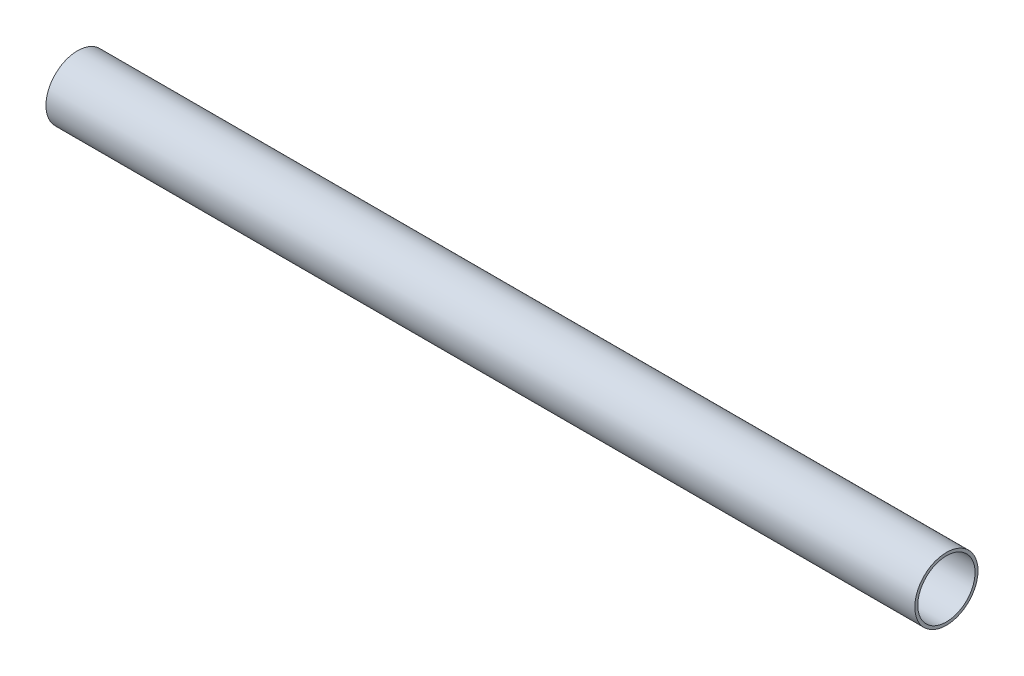
ISO-10303-21;
HEADER;
FILE_DESCRIPTION(('STEP AP214'),'2;1');
FILE_NAME('part.step','',(''),(''),'','','');
FILE_SCHEMA(('AUTOMOTIVE_DESIGN { 1 0 10303 214 1 1 1 1 }'));
ENDSEC;
DATA;
#1=APPLICATION_CONTEXT('core data for automotive mechanical design processes');
#2=APPLICATION_PROTOCOL_DEFINITION('international standard','automotive_design',2000,#1);
#3=PRODUCT_CONTEXT('',#1,'mechanical');
#4=PRODUCT('Part','Part','',(#3));
#5=PRODUCT_RELATED_PRODUCT_CATEGORY('part','',(#4));
#6=PRODUCT_DEFINITION_FORMATION('','',#4);
#7=PRODUCT_DEFINITION_CONTEXT('part definition',#1,'design');
#8=PRODUCT_DEFINITION('design','',#6,#7);
#9=PRODUCT_DEFINITION_SHAPE('','',#8);
#10=(LENGTH_UNIT() NAMED_UNIT(*) SI_UNIT(.MILLI.,.METRE.));
#11=(NAMED_UNIT(*) PLANE_ANGLE_UNIT() SI_UNIT($,.RADIAN.));
#12=(NAMED_UNIT(*) SI_UNIT($,.STERADIAN.) SOLID_ANGLE_UNIT());
#13=UNCERTAINTY_MEASURE_WITH_UNIT(LENGTH_MEASURE(1.E-05),#10,'distance_accuracy_value','');
#14=(GEOMETRIC_REPRESENTATION_CONTEXT(3) GLOBAL_UNCERTAINTY_ASSIGNED_CONTEXT((#13)) GLOBAL_UNIT_ASSIGNED_CONTEXT((#10,
#11,#12)) REPRESENTATION_CONTEXT('',''));
#15=CARTESIAN_POINT('',(0.,0.,0.));
#16=DIRECTION('',(0.,0.,1.));
#17=DIRECTION('',(1.,0.,0.));
#18=AXIS2_PLACEMENT_3D('',#15,#16,#17);
#19=CARTESIAN_POINT('',(0.,0.,0.));
#20=DIRECTION('',(1.,0.,0.));
#21=DIRECTION('',(0.,0.,-1.));
#22=AXIS2_PLACEMENT_3D('',#19,#20,#21);
#23=CYLINDRICAL_SURFACE('',#22,7.25);
#24=CARTESIAN_POINT('',(220.,0.,0.));
#25=DIRECTION('',(1.,0.,0.));
#26=DIRECTION('',(0.,0.,-1.));
#27=AXIS2_PLACEMENT_3D('',#24,#25,#26);
#28=CIRCLE('',#27,7.25);
#29=CARTESIAN_POINT('',(220.,0.,-7.25));
#30=VERTEX_POINT('',#29);
#31=EDGE_CURVE('E15',#30,#30,#28,.F.);
#32=ORIENTED_EDGE('',*,*,#31,.F.);
#33=EDGE_LOOP('',(#32));
#34=FACE_BOUND('',#33,.T.);
#35=CARTESIAN_POINT('',(0.,0.,0.));
#36=DIRECTION('',(1.,0.,0.));
#37=DIRECTION('',(0.,0.,-1.));
#38=AXIS2_PLACEMENT_3D('',#35,#36,#37);
#39=CIRCLE('',#38,7.25);
#40=CARTESIAN_POINT('',(0.,0.,-7.25));
#41=VERTEX_POINT('',#40);
#42=EDGE_CURVE('E24',#41,#41,#39,.F.);
#43=ORIENTED_EDGE('',*,*,#42,.T.);
#44=EDGE_LOOP('',(#43));
#45=FACE_BOUND('',#44,.T.);
#46=ADVANCED_FACE('F12',(#34,#45),#23,.F.);
#47=CARTESIAN_POINT('',(220.,0.,0.));
#48=DIRECTION('',(1.,0.,0.));
#49=DIRECTION('',(0.,0.,-1.));
#50=AXIS2_PLACEMENT_3D('',#47,#48,#49);
#51=PLANE('',#50);
#52=ORIENTED_EDGE('',*,*,#31,.T.);
#53=EDGE_LOOP('',(#52));
#54=FACE_BOUND('',#53,.T.);
#55=CARTESIAN_POINT('',(220.,0.,0.));
#56=DIRECTION('',(1.,0.,0.));
#57=DIRECTION('',(0.,0.,-1.));
#58=AXIS2_PLACEMENT_3D('',#55,#56,#57);
#59=CIRCLE('',#58,8.);
#60=CARTESIAN_POINT('',(220.,0.,-8.));
#61=VERTEX_POINT('',#60);
#62=EDGE_CURVE('E19',#61,#61,#59,.F.);
#63=ORIENTED_EDGE('',*,*,#62,.F.);
#64=EDGE_LOOP('',(#63));
#65=FACE_BOUND('',#64,.T.);
#66=ADVANCED_FACE('F32',(#54,#65),#51,.T.);
#67=CARTESIAN_POINT('',(0.,0.,0.));
#68=DIRECTION('',(1.,0.,0.));
#69=DIRECTION('',(0.,0.,-1.));
#70=AXIS2_PLACEMENT_3D('',#67,#68,#69);
#71=PLANE('',#70);
#72=ORIENTED_EDGE('',*,*,#42,.F.);
#73=EDGE_LOOP('',(#72));
#74=FACE_BOUND('',#73,.T.);
#75=CARTESIAN_POINT('',(0.,0.,0.));
#76=DIRECTION('',(1.,0.,0.));
#77=DIRECTION('',(0.,0.,-1.));
#78=AXIS2_PLACEMENT_3D('',#75,#76,#77);
#79=CIRCLE('',#78,8.);
#80=CARTESIAN_POINT('',(0.,0.,-8.));
#81=VERTEX_POINT('',#80);
#82=EDGE_CURVE('E8',#81,#81,#79,.T.);
#83=ORIENTED_EDGE('',*,*,#82,.F.);
#84=EDGE_LOOP('',(#83));
#85=FACE_BOUND('',#84,.T.);
#86=ADVANCED_FACE('F40',(#74,#85),#71,.F.);
#87=CARTESIAN_POINT('',(0.,0.,0.));
#88=DIRECTION('',(1.,0.,0.));
#89=DIRECTION('',(0.,0.,-1.));
#90=AXIS2_PLACEMENT_3D('',#87,#88,#89);
#91=CYLINDRICAL_SURFACE('',#90,8.);
#92=ORIENTED_EDGE('',*,*,#62,.T.);
#93=EDGE_LOOP('',(#92));
#94=FACE_BOUND('',#93,.T.);
#95=ORIENTED_EDGE('',*,*,#82,.T.);
#96=EDGE_LOOP('',(#95));
#97=FACE_BOUND('',#96,.T.);
#98=ADVANCED_FACE('F41',(#94,#97),#91,.T.);
#99=CLOSED_SHELL('',(#46,#66,#86,#98));
#100=MANIFOLD_SOLID_BREP('B1',#99);
#101=ADVANCED_BREP_SHAPE_REPRESENTATION('',(#18,#100),#14);
#102=SHAPE_DEFINITION_REPRESENTATION(#9,#101);
ENDSEC;
END-ISO-10303-21;
